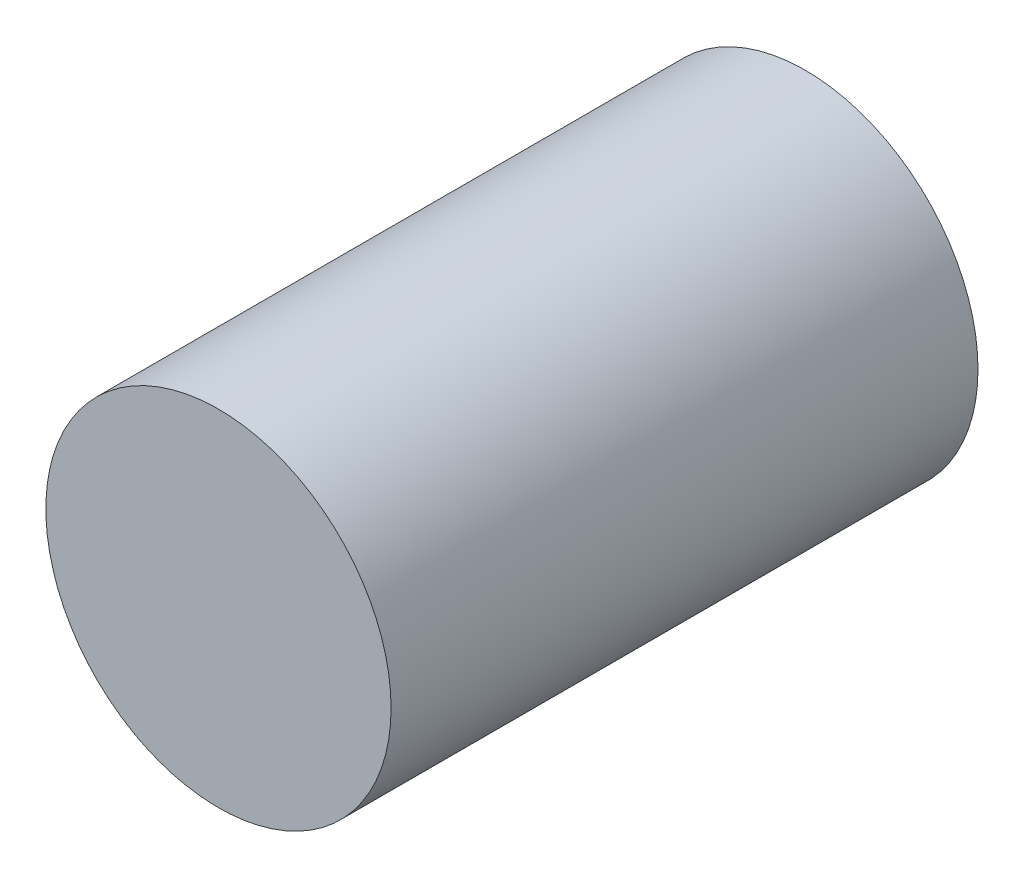
ISO-10303-21;
HEADER;
FILE_DESCRIPTION(('STEP AP214'),'2;1');
FILE_NAME('part.step','',(''),(''),'','','');
FILE_SCHEMA(('AUTOMOTIVE_DESIGN { 1 0 10303 214 1 1 1 1 }'));
ENDSEC;
DATA;
#1=APPLICATION_CONTEXT('core data for automotive mechanical design processes');
#2=APPLICATION_PROTOCOL_DEFINITION('international standard','automotive_design',2000,#1);
#3=PRODUCT_CONTEXT('',#1,'mechanical');
#4=PRODUCT('Part','Part','',(#3));
#5=PRODUCT_RELATED_PRODUCT_CATEGORY('part','',(#4));
#6=PRODUCT_DEFINITION_FORMATION('','',#4);
#7=PRODUCT_DEFINITION_CONTEXT('part definition',#1,'design');
#8=PRODUCT_DEFINITION('design','',#6,#7);
#9=PRODUCT_DEFINITION_SHAPE('','',#8);
#10=(LENGTH_UNIT() NAMED_UNIT(*) SI_UNIT(.MILLI.,.METRE.));
#11=(NAMED_UNIT(*) PLANE_ANGLE_UNIT() SI_UNIT($,.RADIAN.));
#12=(NAMED_UNIT(*) SI_UNIT($,.STERADIAN.) SOLID_ANGLE_UNIT());
#13=UNCERTAINTY_MEASURE_WITH_UNIT(LENGTH_MEASURE(1.E-05),#10,'distance_accuracy_value','');
#14=(GEOMETRIC_REPRESENTATION_CONTEXT(3) GLOBAL_UNCERTAINTY_ASSIGNED_CONTEXT((#13)) GLOBAL_UNIT_ASSIGNED_CONTEXT((#10,
#11,#12)) REPRESENTATION_CONTEXT('',''));
#15=CARTESIAN_POINT('',(0.,0.,0.));
#16=DIRECTION('',(0.,0.,1.));
#17=DIRECTION('',(1.,0.,0.));
#18=AXIS2_PLACEMENT_3D('',#15,#16,#17);
#19=CARTESIAN_POINT('',(0.,0.,85.));
#20=DIRECTION('',(0.,0.,-1.));
#21=DIRECTION('',(-1.,0.,0.));
#22=AXIS2_PLACEMENT_3D('',#19,#20,#21);
#23=CYLINDRICAL_SURFACE('',#22,25.);
#24=CARTESIAN_POINT('',(0.,0.,85.));
#25=DIRECTION('',(0.,0.,1.));
#26=DIRECTION('',(1.,0.,0.));
#27=AXIS2_PLACEMENT_3D('',#24,#25,#26);
#28=CIRCLE('',#27,25.);
#29=CARTESIAN_POINT('',(25.,0.,85.));
#30=VERTEX_POINT('',#29);
#31=EDGE_CURVE('E10',#30,#30,#28,.T.);
#32=ORIENTED_EDGE('',*,*,#31,.F.);
#33=EDGE_LOOP('',(#32));
#34=FACE_BOUND('',#33,.T.);
#35=CARTESIAN_POINT('',(0.,0.,0.));
#36=DIRECTION('',(0.,0.,1.));
#37=DIRECTION('',(1.,0.,0.));
#38=AXIS2_PLACEMENT_3D('',#35,#36,#37);
#39=CIRCLE('',#38,25.);
#40=CARTESIAN_POINT('',(25.,0.,0.));
#41=VERTEX_POINT('',#40);
#42=EDGE_CURVE('E34',#41,#41,#39,.T.);
#43=ORIENTED_EDGE('',*,*,#42,.T.);
#44=EDGE_LOOP('',(#43));
#45=FACE_BOUND('',#44,.T.);
#46=ADVANCED_FACE('F31',(#34,#45),#23,.T.);
#47=CARTESIAN_POINT('',(0.,0.,85.));
#48=DIRECTION('',(0.,0.,1.));
#49=DIRECTION('',(1.,0.,0.));
#50=AXIS2_PLACEMENT_3D('',#47,#48,#49);
#51=PLANE('',#50);
#52=ORIENTED_EDGE('',*,*,#31,.T.);
#53=EDGE_LOOP('',(#52));
#54=FACE_BOUND('',#53,.T.);
#55=ADVANCED_FACE('F46',(#54),#51,.T.);
#56=CARTESIAN_POINT('',(0.,0.,0.));
#57=DIRECTION('',(0.,0.,1.));
#58=DIRECTION('',(1.,0.,0.));
#59=AXIS2_PLACEMENT_3D('',#56,#57,#58);
#60=PLANE('',#59);
#61=ORIENTED_EDGE('',*,*,#42,.F.);
#62=EDGE_LOOP('',(#61));
#63=FACE_BOUND('',#62,.T.);
#64=ADVANCED_FACE('F44',(#63),#60,.F.);
#65=CLOSED_SHELL('',(#46,#55,#64));
#66=MANIFOLD_SOLID_BREP('B2',#65);
#67=ADVANCED_BREP_SHAPE_REPRESENTATION('',(#18,#66),#14);
#68=SHAPE_DEFINITION_REPRESENTATION(#9,#67);
ENDSEC;
END-ISO-10303-21;
